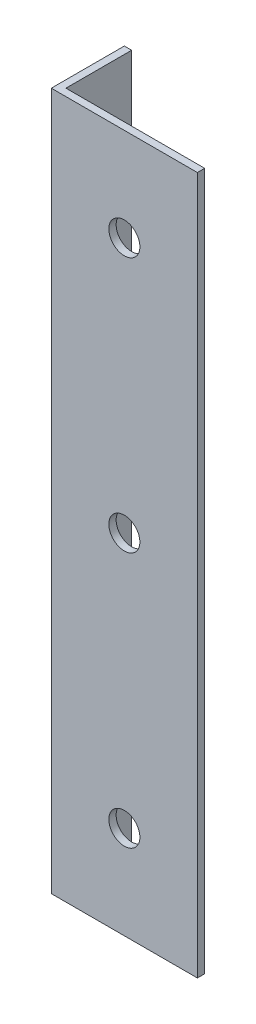
ISO-10303-21;
HEADER;
FILE_DESCRIPTION(('STEP AP214'),'2;1');
FILE_NAME('part.step','',(''),(''),'','','');
FILE_SCHEMA(('AUTOMOTIVE_DESIGN { 1 0 10303 214 1 1 1 1 }'));
ENDSEC;
DATA;
#1=APPLICATION_CONTEXT('core data for automotive mechanical design processes');
#2=APPLICATION_PROTOCOL_DEFINITION('international standard','automotive_design',2000,#1);
#3=PRODUCT_CONTEXT('',#1,'mechanical');
#4=PRODUCT('Part','Part','',(#3));
#5=PRODUCT_RELATED_PRODUCT_CATEGORY('part','',(#4));
#6=PRODUCT_DEFINITION_FORMATION('','',#4);
#7=PRODUCT_DEFINITION_CONTEXT('part definition',#1,'design');
#8=PRODUCT_DEFINITION('design','',#6,#7);
#9=PRODUCT_DEFINITION_SHAPE('','',#8);
#10=(LENGTH_UNIT() NAMED_UNIT(*) SI_UNIT(.MILLI.,.METRE.));
#11=(NAMED_UNIT(*) PLANE_ANGLE_UNIT() SI_UNIT($,.RADIAN.));
#12=(NAMED_UNIT(*) SI_UNIT($,.STERADIAN.) SOLID_ANGLE_UNIT());
#13=UNCERTAINTY_MEASURE_WITH_UNIT(LENGTH_MEASURE(1.E-05),#10,'distance_accuracy_value','');
#14=(GEOMETRIC_REPRESENTATION_CONTEXT(3) GLOBAL_UNCERTAINTY_ASSIGNED_CONTEXT((#13)) GLOBAL_UNIT_ASSIGNED_CONTEXT((#10,
#11,#12)) REPRESENTATION_CONTEXT('',''));
#15=CARTESIAN_POINT('',(0.,0.,0.));
#16=DIRECTION('',(0.,0.,1.));
#17=DIRECTION('',(1.,0.,0.));
#18=AXIS2_PLACEMENT_3D('',#15,#16,#17);
#19=CARTESIAN_POINT('',(40.,191.,0.));
#20=DIRECTION('',(0.,0.,-1.));
#21=DIRECTION('',(-1.,0.,0.));
#22=AXIS2_PLACEMENT_3D('',#19,#20,#21);
#23=PLANE('',#22);
#24=CARTESIAN_POINT('',(20.,25.5,0.));
#25=DIRECTION('',(0.,0.,1.));
#26=DIRECTION('',(1.,0.,0.));
#27=AXIS2_PLACEMENT_3D('',#24,#25,#26);
#28=CIRCLE('',#27,4.25000000000001);
#29=CARTESIAN_POINT('',(24.25,25.5,0.));
#30=VERTEX_POINT('',#29);
#31=EDGE_CURVE('E154',#30,#30,#28,.T.);
#32=ORIENTED_EDGE('',*,*,#31,.F.);
#33=EDGE_LOOP('',(#32));
#34=FACE_BOUND('',#33,.T.);
#35=CARTESIAN_POINT('',(20.,95.5,0.));
#36=DIRECTION('',(0.,0.,1.));
#37=DIRECTION('',(1.,0.,0.));
#38=AXIS2_PLACEMENT_3D('',#35,#36,#37);
#39=CIRCLE('',#38,4.25000000000001);
#40=CARTESIAN_POINT('',(24.25,95.5,0.));
#41=VERTEX_POINT('',#40);
#42=EDGE_CURVE('E144',#41,#41,#39,.T.);
#43=ORIENTED_EDGE('',*,*,#42,.F.);
#44=EDGE_LOOP('',(#43));
#45=FACE_BOUND('',#44,.T.);
#46=CARTESIAN_POINT('',(20.,165.5,0.));
#47=DIRECTION('',(0.,0.,1.));
#48=DIRECTION('',(1.,0.,0.));
#49=AXIS2_PLACEMENT_3D('',#46,#47,#48);
#50=CIRCLE('',#49,4.25000000000001);
#51=CARTESIAN_POINT('',(24.25,165.5,0.));
#52=VERTEX_POINT('',#51);
#53=EDGE_CURVE('E141',#52,#52,#50,.T.);
#54=ORIENTED_EDGE('',*,*,#53,.F.);
#55=EDGE_LOOP('',(#54));
#56=FACE_BOUND('',#55,.T.);
#57=DIRECTION('',(1.,0.,0.));
#58=VECTOR('',#57,1.);
#59=CARTESIAN_POINT('',(40.,0.,0.));
#60=LINE('',#59,#58);
#61=CARTESIAN_POINT('',(0.,0.,0.));
#62=VERTEX_POINT('',#61);
#63=CARTESIAN_POINT('',(40.,0.,0.));
#64=VERTEX_POINT('',#63);
#65=EDGE_CURVE('E123',#62,#64,#60,.T.);
#66=ORIENTED_EDGE('',*,*,#65,.T.);
#67=DIRECTION('',(0.,-1.,0.));
#68=VECTOR('',#67,1.);
#69=CARTESIAN_POINT('',(40.,191.,0.));
#70=LINE('',#69,#68);
#71=CARTESIAN_POINT('',(40.,191.,0.));
#72=VERTEX_POINT('',#71);
#73=EDGE_CURVE('E11',#72,#64,#70,.T.);
#74=ORIENTED_EDGE('',*,*,#73,.F.);
#75=DIRECTION('',(1.,0.,0.));
#76=VECTOR('',#75,1.);
#77=CARTESIAN_POINT('',(40.,191.,0.));
#78=LINE('',#77,#76);
#79=CARTESIAN_POINT('',(0.,191.,0.));
#80=VERTEX_POINT('',#79);
#81=EDGE_CURVE('E134',#80,#72,#78,.T.);
#82=ORIENTED_EDGE('',*,*,#81,.F.);
#83=DIRECTION('',(0.,-1.,0.));
#84=VECTOR('',#83,1.);
#85=CARTESIAN_POINT('',(0.,191.,0.));
#86=LINE('',#85,#84);
#87=EDGE_CURVE('E119',#80,#62,#86,.T.);
#88=ORIENTED_EDGE('',*,*,#87,.T.);
#89=EDGE_LOOP('',(#66,#74,#82,#88));
#90=FACE_BOUND('',#89,.T.);
#91=ADVANCED_FACE('F37',(#34,#45,#56,#90),#23,.F.);
#92=CARTESIAN_POINT('',(40.,191.,-2.));
#93=DIRECTION('',(-1.,0.,0.));
#94=DIRECTION('',(0.,0.,1.));
#95=AXIS2_PLACEMENT_3D('',#92,#93,#94);
#96=PLANE('',#95);
#97=DIRECTION('',(0.,0.,-1.));
#98=VECTOR('',#97,1.);
#99=CARTESIAN_POINT('',(40.,0.,-2.));
#100=LINE('',#99,#98);
#101=CARTESIAN_POINT('',(40.,0.,-2.));
#102=VERTEX_POINT('',#101);
#103=EDGE_CURVE('E126',#64,#102,#100,.T.);
#104=ORIENTED_EDGE('',*,*,#103,.T.);
#105=DIRECTION('',(0.,-1.,0.));
#106=VECTOR('',#105,1.);
#107=CARTESIAN_POINT('',(40.,191.,-2.));
#108=LINE('',#107,#106);
#109=CARTESIAN_POINT('',(40.,191.,-2.));
#110=VERTEX_POINT('',#109);
#111=EDGE_CURVE('E46',#110,#102,#108,.T.);
#112=ORIENTED_EDGE('',*,*,#111,.F.);
#113=DIRECTION('',(0.,0.,-1.));
#114=VECTOR('',#113,1.);
#115=CARTESIAN_POINT('',(40.,191.,-2.));
#116=LINE('',#115,#114);
#117=EDGE_CURVE('E92',#72,#110,#116,.T.);
#118=ORIENTED_EDGE('',*,*,#117,.F.);
#119=ORIENTED_EDGE('',*,*,#73,.T.);
#120=EDGE_LOOP('',(#104,#112,#118,#119));
#121=FACE_BOUND('',#120,.T.);
#122=ADVANCED_FACE('F161',(#121),#96,.F.);
#123=CARTESIAN_POINT('',(2.,191.,-1.99999999999999));
#124=DIRECTION('',(0.,0.,1.));
#125=DIRECTION('',(1.,0.,0.));
#126=AXIS2_PLACEMENT_3D('',#123,#124,#125);
#127=PLANE('',#126);
#128=CARTESIAN_POINT('',(20.,25.5,-1.99999999999999));
#129=DIRECTION('',(0.,0.,1.));
#130=DIRECTION('',(1.,0.,0.));
#131=AXIS2_PLACEMENT_3D('',#128,#129,#130);
#132=CIRCLE('',#131,4.25000000000001);
#133=CARTESIAN_POINT('',(24.25,25.5,-1.99999999999999));
#134=VERTEX_POINT('',#133);
#135=EDGE_CURVE('E40',#134,#134,#132,.T.);
#136=ORIENTED_EDGE('',*,*,#135,.T.);
#137=EDGE_LOOP('',(#136));
#138=FACE_BOUND('',#137,.T.);
#139=CARTESIAN_POINT('',(20.,95.5,-1.99999999999999));
#140=DIRECTION('',(0.,0.,1.));
#141=DIRECTION('',(1.,0.,0.));
#142=AXIS2_PLACEMENT_3D('',#139,#140,#141);
#143=CIRCLE('',#142,4.25000000000001);
#144=CARTESIAN_POINT('',(24.25,95.5,-1.99999999999999));
#145=VERTEX_POINT('',#144);
#146=EDGE_CURVE('E142',#145,#145,#143,.T.);
#147=ORIENTED_EDGE('',*,*,#146,.T.);
#148=EDGE_LOOP('',(#147));
#149=FACE_BOUND('',#148,.T.);
#150=CARTESIAN_POINT('',(20.,165.5,-1.99999999999999));
#151=DIRECTION('',(0.,0.,1.));
#152=DIRECTION('',(1.,0.,0.));
#153=AXIS2_PLACEMENT_3D('',#150,#151,#152);
#154=CIRCLE('',#153,4.25000000000001);
#155=CARTESIAN_POINT('',(24.25,165.5,-1.99999999999999));
#156=VERTEX_POINT('',#155);
#157=EDGE_CURVE('E127',#156,#156,#154,.T.);
#158=ORIENTED_EDGE('',*,*,#157,.T.);
#159=EDGE_LOOP('',(#158));
#160=FACE_BOUND('',#159,.T.);
#161=DIRECTION('',(-1.,0.,0.));
#162=VECTOR('',#161,1.);
#163=CARTESIAN_POINT('',(2.,0.,-1.99999999999999));
#164=LINE('',#163,#162);
#165=CARTESIAN_POINT('',(2.,0.,-1.99999999999999));
#166=VERTEX_POINT('',#165);
#167=EDGE_CURVE('E129',#102,#166,#164,.T.);
#168=ORIENTED_EDGE('',*,*,#167,.T.);
#169=DIRECTION('',(0.,-1.,0.));
#170=VECTOR('',#169,1.);
#171=CARTESIAN_POINT('',(2.,191.,-1.99999999999999));
#172=LINE('',#171,#170);
#173=CARTESIAN_POINT('',(2.,191.,-1.99999999999999));
#174=VERTEX_POINT('',#173);
#175=EDGE_CURVE('E114',#174,#166,#172,.T.);
#176=ORIENTED_EDGE('',*,*,#175,.F.);
#177=DIRECTION('',(-1.,0.,0.));
#178=VECTOR('',#177,1.);
#179=CARTESIAN_POINT('',(2.,191.,-1.99999999999999));
#180=LINE('',#179,#178);
#181=EDGE_CURVE('E105',#110,#174,#180,.T.);
#182=ORIENTED_EDGE('',*,*,#181,.F.);
#183=ORIENTED_EDGE('',*,*,#111,.T.);
#184=EDGE_LOOP('',(#168,#176,#182,#183));
#185=FACE_BOUND('',#184,.T.);
#186=ADVANCED_FACE('F164',(#138,#149,#160,#185),#127,.F.);
#187=CARTESIAN_POINT('',(2.,191.,-20.));
#188=DIRECTION('',(-1.,0.,0.));
#189=DIRECTION('',(0.,0.,1.));
#190=AXIS2_PLACEMENT_3D('',#187,#188,#189);
#191=PLANE('',#190);
#192=CARTESIAN_POINT('',(1.99999999999999,178.999999999999,-9.99999999999966));
#193=DIRECTION('',(-1.,0.,0.));
#194=DIRECTION('',(0.,0.,1.));
#195=AXIS2_PLACEMENT_3D('',#192,#193,#194);
#196=CIRCLE('',#195,2.25);
#197=CARTESIAN_POINT('',(2.,178.999999999999,-7.74999999999966));
#198=VERTEX_POINT('',#197);
#199=EDGE_CURVE('E302',#198,#198,#196,.T.);
#200=ORIENTED_EDGE('',*,*,#199,.T.);
#201=EDGE_LOOP('',(#200));
#202=FACE_BOUND('',#201,.T.);
#203=CARTESIAN_POINT('',(1.99999999999999,11.9999999999984,-9.99999999999893));
#204=DIRECTION('',(-1.,0.,0.));
#205=DIRECTION('',(0.,0.,1.));
#206=AXIS2_PLACEMENT_3D('',#203,#204,#205);
#207=CIRCLE('',#206,2.25);
#208=CARTESIAN_POINT('',(2.,11.9999999999984,-7.74999999999893));
#209=VERTEX_POINT('',#208);
#210=EDGE_CURVE('E306',#209,#209,#207,.T.);
#211=ORIENTED_EDGE('',*,*,#210,.T.);
#212=EDGE_LOOP('',(#211));
#213=FACE_BOUND('',#212,.T.);
#214=DIRECTION('',(0.,0.,-1.));
#215=VECTOR('',#214,1.);
#216=CARTESIAN_POINT('',(2.,0.,-20.));
#217=LINE('',#216,#215);
#218=CARTESIAN_POINT('',(2.,0.,-20.));
#219=VERTEX_POINT('',#218);
#220=EDGE_CURVE('E113',#166,#219,#217,.T.);
#221=ORIENTED_EDGE('',*,*,#220,.T.);
#222=DIRECTION('',(0.,-1.,0.));
#223=VECTOR('',#222,1.);
#224=CARTESIAN_POINT('',(2.,191.,-20.));
#225=LINE('',#224,#223);
#226=CARTESIAN_POINT('',(2.,191.,-20.));
#227=VERTEX_POINT('',#226);
#228=EDGE_CURVE('E110',#227,#219,#225,.T.);
#229=ORIENTED_EDGE('',*,*,#228,.F.);
#230=DIRECTION('',(0.,0.,-1.));
#231=VECTOR('',#230,1.);
#232=CARTESIAN_POINT('',(2.,191.,-20.));
#233=LINE('',#232,#231);
#234=EDGE_CURVE('E99',#174,#227,#233,.T.);
#235=ORIENTED_EDGE('',*,*,#234,.F.);
#236=ORIENTED_EDGE('',*,*,#175,.T.);
#237=EDGE_LOOP('',(#221,#229,#235,#236));
#238=FACE_BOUND('',#237,.T.);
#239=ADVANCED_FACE('F111',(#202,#213,#238),#191,.F.);
#240=CARTESIAN_POINT('',(0.,191.,-20.));
#241=DIRECTION('',(0.,0.,1.));
#242=DIRECTION('',(1.,0.,0.));
#243=AXIS2_PLACEMENT_3D('',#240,#241,#242);
#244=PLANE('',#243);
#245=DIRECTION('',(-1.,0.,0.));
#246=VECTOR('',#245,1.);
#247=CARTESIAN_POINT('',(0.,0.,-20.));
#248=LINE('',#247,#246);
#249=CARTESIAN_POINT('',(0.,0.,-20.));
#250=VERTEX_POINT('',#249);
#251=EDGE_CURVE('E78',#219,#250,#248,.T.);
#252=ORIENTED_EDGE('',*,*,#251,.T.);
#253=DIRECTION('',(0.,-1.,0.));
#254=VECTOR('',#253,1.);
#255=CARTESIAN_POINT('',(0.,191.,-20.));
#256=LINE('',#255,#254);
#257=CARTESIAN_POINT('',(0.,191.,-20.));
#258=VERTEX_POINT('',#257);
#259=EDGE_CURVE('E115',#258,#250,#256,.T.);
#260=ORIENTED_EDGE('',*,*,#259,.F.);
#261=DIRECTION('',(-1.,0.,0.));
#262=VECTOR('',#261,1.);
#263=CARTESIAN_POINT('',(0.,191.,-20.));
#264=LINE('',#263,#262);
#265=EDGE_CURVE('E103',#227,#258,#264,.T.);
#266=ORIENTED_EDGE('',*,*,#265,.F.);
#267=ORIENTED_EDGE('',*,*,#228,.T.);
#268=EDGE_LOOP('',(#252,#260,#266,#267));
#269=FACE_BOUND('',#268,.T.);
#270=ADVANCED_FACE('F117',(#269),#244,.F.);
#271=CARTESIAN_POINT('',(0.,191.,0.));
#272=DIRECTION('',(1.,0.,0.));
#273=DIRECTION('',(0.,0.,-1.));
#274=AXIS2_PLACEMENT_3D('',#271,#272,#273);
#275=PLANE('',#274);
#276=CARTESIAN_POINT('',(0.,178.999999999999,-9.99999999999966));
#277=DIRECTION('',(-1.,0.,0.));
#278=DIRECTION('',(0.,0.,1.));
#279=AXIS2_PLACEMENT_3D('',#276,#277,#278);
#280=CIRCLE('',#279,2.25);
#281=CARTESIAN_POINT('',(0.,178.999999999999,-7.74999999999966));
#282=VERTEX_POINT('',#281);
#283=EDGE_CURVE('E299',#282,#282,#280,.T.);
#284=ORIENTED_EDGE('',*,*,#283,.F.);
#285=EDGE_LOOP('',(#284));
#286=FACE_BOUND('',#285,.T.);
#287=CARTESIAN_POINT('',(0.,11.9999999999984,-9.99999999999893));
#288=DIRECTION('',(-1.,0.,0.));
#289=DIRECTION('',(0.,0.,1.));
#290=AXIS2_PLACEMENT_3D('',#287,#288,#289);
#291=CIRCLE('',#290,2.25);
#292=CARTESIAN_POINT('',(0.,11.9999999999984,-7.74999999999893));
#293=VERTEX_POINT('',#292);
#294=EDGE_CURVE('E303',#293,#293,#291,.T.);
#295=ORIENTED_EDGE('',*,*,#294,.F.);
#296=EDGE_LOOP('',(#295));
#297=FACE_BOUND('',#296,.T.);
#298=DIRECTION('',(0.,0.,1.));
#299=VECTOR('',#298,1.);
#300=CARTESIAN_POINT('',(0.,0.,0.));
#301=LINE('',#300,#299);
#302=EDGE_CURVE('E84',#250,#62,#301,.T.);
#303=ORIENTED_EDGE('',*,*,#302,.T.);
#304=ORIENTED_EDGE('',*,*,#87,.F.);
#305=DIRECTION('',(0.,0.,1.));
#306=VECTOR('',#305,1.);
#307=CARTESIAN_POINT('',(0.,191.,0.));
#308=LINE('',#307,#306);
#309=EDGE_CURVE('E55',#258,#80,#308,.T.);
#310=ORIENTED_EDGE('',*,*,#309,.F.);
#311=ORIENTED_EDGE('',*,*,#259,.T.);
#312=EDGE_LOOP('',(#303,#304,#310,#311));
#313=FACE_BOUND('',#312,.T.);
#314=ADVANCED_FACE('F169',(#286,#297,#313),#275,.F.);
#315=CARTESIAN_POINT('',(0.,191.,0.));
#316=DIRECTION('',(0.,-1.,0.));
#317=DIRECTION('',(0.,0.,-1.));
#318=AXIS2_PLACEMENT_3D('',#315,#316,#317);
#319=PLANE('',#318);
#320=ORIENTED_EDGE('',*,*,#81,.T.);
#321=ORIENTED_EDGE('',*,*,#117,.T.);
#322=ORIENTED_EDGE('',*,*,#181,.T.);
#323=ORIENTED_EDGE('',*,*,#234,.T.);
#324=ORIENTED_EDGE('',*,*,#265,.T.);
#325=ORIENTED_EDGE('',*,*,#309,.T.);
#326=EDGE_LOOP('',(#320,#321,#322,#323,#324,#325));
#327=FACE_BOUND('',#326,.T.);
#328=ADVANCED_FACE('F101',(#327),#319,.F.);
#329=CARTESIAN_POINT('',(0.,0.,0.));
#330=DIRECTION('',(0.,-1.,0.));
#331=DIRECTION('',(0.,0.,-1.));
#332=AXIS2_PLACEMENT_3D('',#329,#330,#331);
#333=PLANE('',#332);
#334=ORIENTED_EDGE('',*,*,#65,.F.);
#335=ORIENTED_EDGE('',*,*,#302,.F.);
#336=ORIENTED_EDGE('',*,*,#251,.F.);
#337=ORIENTED_EDGE('',*,*,#220,.F.);
#338=ORIENTED_EDGE('',*,*,#167,.F.);
#339=ORIENTED_EDGE('',*,*,#103,.F.);
#340=EDGE_LOOP('',(#334,#335,#336,#337,#338,#339));
#341=FACE_BOUND('',#340,.T.);
#342=ADVANCED_FACE('F167',(#341),#333,.T.);
#343=CARTESIAN_POINT('',(20.,165.5,-20.));
#344=DIRECTION('',(0.,0.,1.));
#345=DIRECTION('',(1.,0.,0.));
#346=AXIS2_PLACEMENT_3D('',#343,#344,#345);
#347=CYLINDRICAL_SURFACE('',#346,4.25000000000001);
#348=ORIENTED_EDGE('',*,*,#53,.T.);
#349=EDGE_LOOP('',(#348));
#350=FACE_BOUND('',#349,.T.);
#351=ORIENTED_EDGE('',*,*,#157,.F.);
#352=EDGE_LOOP('',(#351));
#353=FACE_BOUND('',#352,.T.);
#354=ADVANCED_FACE('F195',(#350,#353),#347,.F.);
#355=CARTESIAN_POINT('',(20.,95.5,-20.));
#356=DIRECTION('',(0.,0.,1.));
#357=DIRECTION('',(1.,0.,0.));
#358=AXIS2_PLACEMENT_3D('',#355,#356,#357);
#359=CYLINDRICAL_SURFACE('',#358,4.25000000000001);
#360=ORIENTED_EDGE('',*,*,#42,.T.);
#361=EDGE_LOOP('',(#360));
#362=FACE_BOUND('',#361,.T.);
#363=ORIENTED_EDGE('',*,*,#146,.F.);
#364=EDGE_LOOP('',(#363));
#365=FACE_BOUND('',#364,.T.);
#366=ADVANCED_FACE('F198',(#362,#365),#359,.F.);
#367=CARTESIAN_POINT('',(20.,25.5,-20.));
#368=DIRECTION('',(0.,0.,1.));
#369=DIRECTION('',(1.,0.,0.));
#370=AXIS2_PLACEMENT_3D('',#367,#368,#369);
#371=CYLINDRICAL_SURFACE('',#370,4.25000000000001);
#372=ORIENTED_EDGE('',*,*,#31,.T.);
#373=EDGE_LOOP('',(#372));
#374=FACE_BOUND('',#373,.T.);
#375=ORIENTED_EDGE('',*,*,#135,.F.);
#376=EDGE_LOOP('',(#375));
#377=FACE_BOUND('',#376,.T.);
#378=ADVANCED_FACE('F212',(#374,#377),#371,.F.);
#379=CARTESIAN_POINT('',(40.,11.9999999999984,-9.99999999999893));
#380=DIRECTION('',(-1.,0.,0.));
#381=DIRECTION('',(0.,0.,1.));
#382=AXIS2_PLACEMENT_3D('',#379,#380,#381);
#383=CYLINDRICAL_SURFACE('',#382,2.25);
#384=ORIENTED_EDGE('',*,*,#294,.T.);
#385=EDGE_LOOP('',(#384));
#386=FACE_BOUND('',#385,.T.);
#387=ORIENTED_EDGE('',*,*,#210,.F.);
#388=EDGE_LOOP('',(#387));
#389=FACE_BOUND('',#388,.T.);
#390=ADVANCED_FACE('F214',(#386,#389),#383,.F.);
#391=CARTESIAN_POINT('',(40.,178.999999999999,-9.99999999999966));
#392=DIRECTION('',(-1.,0.,0.));
#393=DIRECTION('',(0.,0.,1.));
#394=AXIS2_PLACEMENT_3D('',#391,#392,#393);
#395=CYLINDRICAL_SURFACE('',#394,2.25);
#396=ORIENTED_EDGE('',*,*,#283,.T.);
#397=EDGE_LOOP('',(#396));
#398=FACE_BOUND('',#397,.T.);
#399=ORIENTED_EDGE('',*,*,#199,.F.);
#400=EDGE_LOOP('',(#399));
#401=FACE_BOUND('',#400,.T.);
#402=ADVANCED_FACE('F221',(#398,#401),#395,.F.);
#403=CLOSED_SHELL('',(#91,#122,#186,#239,#270,#314,#328,#342,#354,#366,#378,#390,#402));
#404=MANIFOLD_SOLID_BREP('B2',#403);
#405=ADVANCED_BREP_SHAPE_REPRESENTATION('',(#18,#404),#14);
#406=SHAPE_DEFINITION_REPRESENTATION(#9,#405);
ENDSEC;
END-ISO-10303-21;
